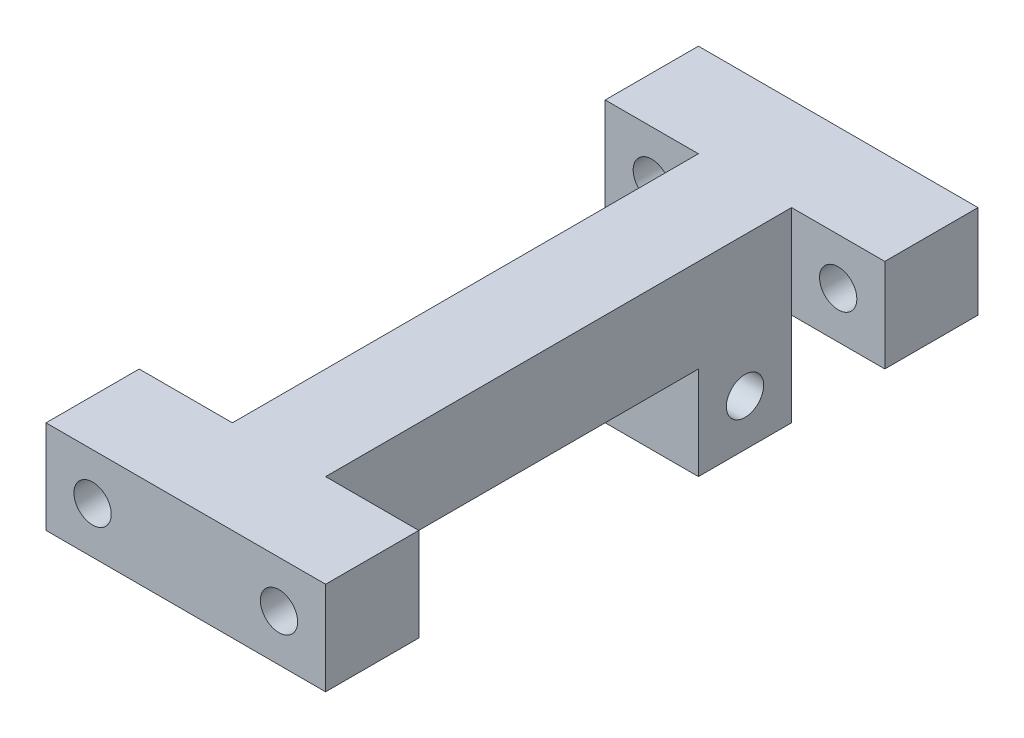
ISO-10303-21;
HEADER;
FILE_DESCRIPTION(('STEP AP214'),'2;1');
FILE_NAME('part.step','',(''),(''),'','','');
FILE_SCHEMA(('AUTOMOTIVE_DESIGN { 1 0 10303 214 1 1 1 1 }'));
ENDSEC;
DATA;
#1=APPLICATION_CONTEXT('core data for automotive mechanical design processes');
#2=APPLICATION_PROTOCOL_DEFINITION('international standard','automotive_design',2000,#1);
#3=PRODUCT_CONTEXT('',#1,'mechanical');
#4=PRODUCT('Part','Part','',(#3));
#5=PRODUCT_RELATED_PRODUCT_CATEGORY('part','',(#4));
#6=PRODUCT_DEFINITION_FORMATION('','',#4);
#7=PRODUCT_DEFINITION_CONTEXT('part definition',#1,'design');
#8=PRODUCT_DEFINITION('design','',#6,#7);
#9=PRODUCT_DEFINITION_SHAPE('','',#8);
#10=(LENGTH_UNIT() NAMED_UNIT(*) SI_UNIT(.MILLI.,.METRE.));
#11=(NAMED_UNIT(*) PLANE_ANGLE_UNIT() SI_UNIT($,.RADIAN.));
#12=(NAMED_UNIT(*) SI_UNIT($,.STERADIAN.) SOLID_ANGLE_UNIT());
#13=UNCERTAINTY_MEASURE_WITH_UNIT(LENGTH_MEASURE(1.E-05),#10,'distance_accuracy_value','');
#14=(GEOMETRIC_REPRESENTATION_CONTEXT(3) GLOBAL_UNCERTAINTY_ASSIGNED_CONTEXT((#13)) GLOBAL_UNIT_ASSIGNED_CONTEXT((#10,
#11,#12)) REPRESENTATION_CONTEXT('',''));
#15=CARTESIAN_POINT('',(0.,0.,0.));
#16=DIRECTION('',(0.,0.,1.));
#17=DIRECTION('',(1.,0.,0.));
#18=AXIS2_PLACEMENT_3D('',#15,#16,#17);
#19=CARTESIAN_POINT('',(-59.,50.,0.));
#20=DIRECTION('',(0.,-1.,0.));
#21=DIRECTION('',(0.,0.,-1.));
#22=AXIS2_PLACEMENT_3D('',#19,#20,#21);
#23=PLANE('',#22);
#24=DIRECTION('',(0.,0.,1.));
#25=VECTOR('',#24,1.);
#26=CARTESIAN_POINT('',(0.,50.,0.));
#27=LINE('',#26,#25);
#28=CARTESIAN_POINT('',(0.,50.,-200.));
#29=VERTEX_POINT('',#28);
#30=CARTESIAN_POINT('',(0.,50.,-50.));
#31=VERTEX_POINT('',#30);
#32=EDGE_CURVE('E192',#29,#31,#27,.T.);
#33=ORIENTED_EDGE('',*,*,#32,.F.);
#34=DIRECTION('',(1.,0.,0.));
#35=VECTOR('',#34,1.);
#36=CARTESIAN_POINT('',(-59.,50.,-200.));
#37=LINE('',#36,#35);
#38=CARTESIAN_POINT('',(50.0000000000001,50.,-200.));
#39=VERTEX_POINT('',#38);
#40=EDGE_CURVE('E279',#29,#39,#37,.T.);
#41=ORIENTED_EDGE('',*,*,#40,.T.);
#42=DIRECTION('',(0.,0.,-1.));
#43=VECTOR('',#42,1.);
#44=CARTESIAN_POINT('',(50.0000000000001,50.,0.));
#45=LINE('',#44,#43);
#46=CARTESIAN_POINT('',(50.0000000000001,50.,-50.));
#47=VERTEX_POINT('',#46);
#48=EDGE_CURVE('E197',#47,#39,#45,.T.);
#49=ORIENTED_EDGE('',*,*,#48,.F.);
#50=DIRECTION('',(1.,0.,0.));
#51=VECTOR('',#50,1.);
#52=CARTESIAN_POINT('',(-59.,50.,-50.));
#53=LINE('',#52,#51);
#54=EDGE_CURVE('E285',#31,#47,#53,.T.);
#55=ORIENTED_EDGE('',*,*,#54,.F.);
#56=EDGE_LOOP('',(#33,#41,#49,#55));
#57=FACE_BOUND('',#56,.T.);
#58=ADVANCED_FACE('F35',(#57),#23,.T.);
#59=DIRECTION('',(1.,0.,0.));
#60=VECTOR('',#59,1.);
#61=CARTESIAN_POINT('',(0.,50.,-250.));
#62=LINE('',#61,#60);
#63=CARTESIAN_POINT('',(-50.,50.,-250.));
#64=VERTEX_POINT('',#63);
#65=CARTESIAN_POINT('',(0.,50.,-250.));
#66=VERTEX_POINT('',#65);
#67=EDGE_CURVE('E183',#64,#66,#62,.T.);
#68=ORIENTED_EDGE('',*,*,#67,.F.);
#69=DIRECTION('',(0.,0.,-1.));
#70=VECTOR('',#69,1.);
#71=CARTESIAN_POINT('',(-50.,50.,0.));
#72=LINE('',#71,#70);
#73=CARTESIAN_POINT('',(-50.,50.,-300.));
#74=VERTEX_POINT('',#73);
#75=EDGE_CURVE('E253',#64,#74,#72,.T.);
#76=ORIENTED_EDGE('',*,*,#75,.T.);
#77=DIRECTION('',(-1.,0.,0.));
#78=VECTOR('',#77,1.);
#79=CARTESIAN_POINT('',(100.,50.,-300.));
#80=LINE('',#79,#78);
#81=CARTESIAN_POINT('',(100.,50.,-300.));
#82=VERTEX_POINT('',#81);
#83=EDGE_CURVE('E226',#82,#74,#80,.T.);
#84=ORIENTED_EDGE('',*,*,#83,.F.);
#85=DIRECTION('',(0.,0.,-1.));
#86=VECTOR('',#85,1.);
#87=CARTESIAN_POINT('',(100.,50.,0.));
#88=LINE('',#87,#86);
#89=CARTESIAN_POINT('',(100.,50.,-250.));
#90=VERTEX_POINT('',#89);
#91=EDGE_CURVE('E257',#90,#82,#88,.T.);
#92=ORIENTED_EDGE('',*,*,#91,.F.);
#93=DIRECTION('',(1.,0.,0.));
#94=VECTOR('',#93,1.);
#95=CARTESIAN_POINT('',(50.0000000000001,50.,-250.));
#96=LINE('',#95,#94);
#97=CARTESIAN_POINT('',(50.0000000000001,50.,-250.));
#98=VERTEX_POINT('',#97);
#99=EDGE_CURVE('E60',#98,#90,#96,.T.);
#100=ORIENTED_EDGE('',*,*,#99,.F.);
#101=DIRECTION('',(-1.,0.,0.));
#102=VECTOR('',#101,1.);
#103=CARTESIAN_POINT('',(100.,50.,-250.));
#104=LINE('',#103,#102);
#105=EDGE_CURVE('E11',#98,#66,#104,.T.);
#106=ORIENTED_EDGE('',*,*,#105,.T.);
#107=EDGE_LOOP('',(#68,#76,#84,#92,#100,#106));
#108=FACE_BOUND('',#107,.T.);
#109=ADVANCED_FACE('F373',(#108),#23,.T.);
#110=CARTESIAN_POINT('',(-50.,0.,0.));
#111=DIRECTION('',(-1.,0.,0.));
#112=DIRECTION('',(0.,0.,-1.));
#113=AXIS2_PLACEMENT_3D('',#110,#111,#112);
#114=PLANE('',#113);
#115=DIRECTION('',(0.,-1.,0.));
#116=VECTOR('',#115,1.);
#117=CARTESIAN_POINT('',(-50.,100.,-250.));
#118=LINE('',#117,#116);
#119=CARTESIAN_POINT('',(-50.,100.,-250.));
#120=VERTEX_POINT('',#119);
#121=EDGE_CURVE('E198',#120,#64,#118,.T.);
#122=ORIENTED_EDGE('',*,*,#121,.F.);
#123=DIRECTION('',(0.,0.,1.));
#124=VECTOR('',#123,1.);
#125=CARTESIAN_POINT('',(-50.,100.,0.));
#126=LINE('',#125,#124);
#127=CARTESIAN_POINT('',(-50.,100.,-300.));
#128=VERTEX_POINT('',#127);
#129=EDGE_CURVE('E251',#128,#120,#126,.T.);
#130=ORIENTED_EDGE('',*,*,#129,.F.);
#131=DIRECTION('',(0.,1.,0.));
#132=VECTOR('',#131,1.);
#133=CARTESIAN_POINT('',(-50.,50.,-300.));
#134=LINE('',#133,#132);
#135=EDGE_CURVE('E229',#74,#128,#134,.T.);
#136=ORIENTED_EDGE('',*,*,#135,.F.);
#137=ORIENTED_EDGE('',*,*,#75,.F.);
#138=EDGE_LOOP('',(#122,#130,#136,#137));
#139=FACE_BOUND('',#138,.T.);
#140=ADVANCED_FACE('F377',(#139),#114,.T.);
#141=CARTESIAN_POINT('',(100.,0.,0.));
#142=DIRECTION('',(1.,0.,0.));
#143=DIRECTION('',(0.,0.,-1.));
#144=AXIS2_PLACEMENT_3D('',#141,#142,#143);
#145=PLANE('',#144);
#146=DIRECTION('',(0.,-1.,0.));
#147=VECTOR('',#146,1.);
#148=CARTESIAN_POINT('',(100.,100.,0.));
#149=LINE('',#148,#147);
#150=CARTESIAN_POINT('',(100.,100.,0.));
#151=VERTEX_POINT('',#150);
#152=CARTESIAN_POINT('',(100.,50.,0.));
#153=VERTEX_POINT('',#152);
#154=EDGE_CURVE('E219',#151,#153,#149,.T.);
#155=ORIENTED_EDGE('',*,*,#154,.F.);
#156=DIRECTION('',(0.,0.,1.));
#157=VECTOR('',#156,1.);
#158=CARTESIAN_POINT('',(100.,100.,0.));
#159=LINE('',#158,#157);
#160=CARTESIAN_POINT('',(100.,100.,50.));
#161=VERTEX_POINT('',#160);
#162=EDGE_CURVE('E261',#151,#161,#159,.T.);
#163=ORIENTED_EDGE('',*,*,#162,.T.);
#164=DIRECTION('',(0.,1.,0.));
#165=VECTOR('',#164,1.);
#166=CARTESIAN_POINT('',(100.,50.,50.));
#167=LINE('',#166,#165);
#168=CARTESIAN_POINT('',(100.,50.,50.));
#169=VERTEX_POINT('',#168);
#170=EDGE_CURVE('E241',#169,#161,#167,.T.);
#171=ORIENTED_EDGE('',*,*,#170,.F.);
#172=EDGE_CURVE('E258',#169,#153,#88,.T.);
#173=ORIENTED_EDGE('',*,*,#172,.T.);
#174=EDGE_LOOP('',(#155,#163,#171,#173));
#175=FACE_BOUND('',#174,.T.);
#176=ADVANCED_FACE('F456',(#175),#145,.T.);
#177=CARTESIAN_POINT('',(50.0000000000001,0.,-250.));
#178=DIRECTION('',(0.,0.,1.));
#179=DIRECTION('',(1.,0.,0.));
#180=AXIS2_PLACEMENT_3D('',#177,#178,#179);
#181=PLANE('',#180);
#182=ORIENTED_EDGE('',*,*,#105,.F.);
#183=DIRECTION('',(0.,1.,0.));
#184=VECTOR('',#183,1.);
#185=CARTESIAN_POINT('',(50.0000000000001,0.,-250.));
#186=LINE('',#185,#184);
#187=CARTESIAN_POINT('',(50.0000000000001,0.,-250.));
#188=VERTEX_POINT('',#187);
#189=EDGE_CURVE('E297',#188,#98,#186,.T.);
#190=ORIENTED_EDGE('',*,*,#189,.F.);
#191=DIRECTION('',(-1.,0.,0.));
#192=VECTOR('',#191,1.);
#193=CARTESIAN_POINT('',(50.0000000000001,0.,-250.));
#194=LINE('',#193,#192);
#195=CARTESIAN_POINT('',(0.,0.,-250.));
#196=VERTEX_POINT('',#195);
#197=EDGE_CURVE('E300',#188,#196,#194,.T.);
#198=ORIENTED_EDGE('',*,*,#197,.T.);
#199=DIRECTION('',(0.,1.,0.));
#200=VECTOR('',#199,1.);
#201=CARTESIAN_POINT('',(0.,0.,-250.));
#202=LINE('',#201,#200);
#203=EDGE_CURVE('E293',#196,#66,#202,.T.);
#204=ORIENTED_EDGE('',*,*,#203,.T.);
#205=EDGE_LOOP('',(#182,#190,#198,#204));
#206=FACE_BOUND('',#205,.T.);
#207=ADVANCED_FACE('F384',(#206),#181,.F.);
#208=CARTESIAN_POINT('',(50.0000000000001,0.,0.));
#209=DIRECTION('',(0.,0.,-1.));
#210=DIRECTION('',(-1.,0.,0.));
#211=AXIS2_PLACEMENT_3D('',#208,#209,#210);
#212=PLANE('',#211);
#213=DIRECTION('',(1.,0.,0.));
#214=VECTOR('',#213,1.);
#215=CARTESIAN_POINT('',(-50.,50.,0.));
#216=LINE('',#215,#214);
#217=CARTESIAN_POINT('',(0.,50.,0.));
#218=VERTEX_POINT('',#217);
#219=CARTESIAN_POINT('',(50.0000000000001,50.,0.));
#220=VERTEX_POINT('',#219);
#221=EDGE_CURVE('E44',#218,#220,#216,.T.);
#222=ORIENTED_EDGE('',*,*,#221,.F.);
#223=DIRECTION('',(0.,-1.,0.));
#224=VECTOR('',#223,1.);
#225=CARTESIAN_POINT('',(0.,0.,0.));
#226=LINE('',#225,#224);
#227=CARTESIAN_POINT('',(0.,0.,0.));
#228=VERTEX_POINT('',#227);
#229=EDGE_CURVE('E171',#218,#228,#226,.T.);
#230=ORIENTED_EDGE('',*,*,#229,.T.);
#231=DIRECTION('',(-1.,0.,0.));
#232=VECTOR('',#231,1.);
#233=CARTESIAN_POINT('',(50.0000000000001,0.,0.));
#234=LINE('',#233,#232);
#235=CARTESIAN_POINT('',(50.0000000000001,0.,0.));
#236=VERTEX_POINT('',#235);
#237=EDGE_CURVE('E310',#236,#228,#234,.T.);
#238=ORIENTED_EDGE('',*,*,#237,.F.);
#239=DIRECTION('',(0.,-1.,0.));
#240=VECTOR('',#239,1.);
#241=CARTESIAN_POINT('',(50.0000000000001,0.,0.));
#242=LINE('',#241,#240);
#243=EDGE_CURVE('E290',#220,#236,#242,.T.);
#244=ORIENTED_EDGE('',*,*,#243,.F.);
#245=EDGE_LOOP('',(#222,#230,#238,#244));
#246=FACE_BOUND('',#245,.T.);
#247=ADVANCED_FACE('F37',(#246),#212,.F.);
#248=CARTESIAN_POINT('',(0.,0.,0.));
#249=DIRECTION('',(-1.,0.,0.));
#250=DIRECTION('',(0.,0.,1.));
#251=AXIS2_PLACEMENT_3D('',#248,#249,#250);
#252=PLANE('',#251);
#253=CARTESIAN_POINT('',(0.,25.,-225.));
#254=DIRECTION('',(-1.,0.,0.));
#255=DIRECTION('',(0.,0.,1.));
#256=AXIS2_PLACEMENT_3D('',#253,#254,#255);
#257=CIRCLE('',#256,10.);
#258=CARTESIAN_POINT('',(0.,25.,-215.));
#259=VERTEX_POINT('',#258);
#260=EDGE_CURVE('E268',#259,#259,#257,.T.);
#261=ORIENTED_EDGE('',*,*,#260,.F.);
#262=EDGE_LOOP('',(#261));
#263=FACE_BOUND('',#262,.T.);
#264=DIRECTION('',(0.,1.,0.));
#265=VECTOR('',#264,1.);
#266=CARTESIAN_POINT('',(0.,0.,-200.));
#267=LINE('',#266,#265);
#268=CARTESIAN_POINT('',(0.,0.,-200.));
#269=VERTEX_POINT('',#268);
#270=EDGE_CURVE('E250',#269,#29,#267,.T.);
#271=ORIENTED_EDGE('',*,*,#270,.T.);
#272=ORIENTED_EDGE('',*,*,#32,.T.);
#273=DIRECTION('',(0.,-1.,0.));
#274=VECTOR('',#273,1.);
#275=CARTESIAN_POINT('',(0.,0.,-50.));
#276=LINE('',#275,#274);
#277=CARTESIAN_POINT('',(0.,0.,-50.));
#278=VERTEX_POINT('',#277);
#279=EDGE_CURVE('E313',#31,#278,#276,.T.);
#280=ORIENTED_EDGE('',*,*,#279,.T.);
#281=DIRECTION('',(0.,0.,-1.));
#282=VECTOR('',#281,1.);
#283=CARTESIAN_POINT('',(0.,0.,0.));
#284=LINE('',#283,#282);
#285=EDGE_CURVE('E303',#228,#278,#284,.T.);
#286=ORIENTED_EDGE('',*,*,#285,.F.);
#287=ORIENTED_EDGE('',*,*,#229,.F.);
#288=DIRECTION('',(0.,-1.,0.));
#289=VECTOR('',#288,1.);
#290=CARTESIAN_POINT('',(0.,100.,0.));
#291=LINE('',#290,#289);
#292=CARTESIAN_POINT('',(0.,100.,0.));
#293=VERTEX_POINT('',#292);
#294=EDGE_CURVE('E162',#293,#218,#291,.T.);
#295=ORIENTED_EDGE('',*,*,#294,.F.);
#296=DIRECTION('',(0.,0.,1.));
#297=VECTOR('',#296,1.);
#298=CARTESIAN_POINT('',(0.,100.,0.));
#299=LINE('',#298,#297);
#300=CARTESIAN_POINT('',(0.,100.,-250.));
#301=VERTEX_POINT('',#300);
#302=EDGE_CURVE('E168',#301,#293,#299,.T.);
#303=ORIENTED_EDGE('',*,*,#302,.F.);
#304=DIRECTION('',(0.,-1.,0.));
#305=VECTOR('',#304,1.);
#306=CARTESIAN_POINT('',(0.,100.,-250.));
#307=LINE('',#306,#305);
#308=EDGE_CURVE('E195',#301,#66,#307,.T.);
#309=ORIENTED_EDGE('',*,*,#308,.T.);
#310=ORIENTED_EDGE('',*,*,#203,.F.);
#311=EDGE_CURVE('E302',#269,#196,#284,.T.);
#312=ORIENTED_EDGE('',*,*,#311,.F.);
#313=EDGE_LOOP('',(#271,#272,#280,#286,#287,#295,#303,#309,#310,#312));
#314=FACE_BOUND('',#313,.T.);
#315=CARTESIAN_POINT('',(0.,25.,-25.));
#316=DIRECTION('',(-1.,0.,0.));
#317=DIRECTION('',(0.,0.,1.));
#318=AXIS2_PLACEMENT_3D('',#315,#316,#317);
#319=CIRCLE('',#318,10.);
#320=CARTESIAN_POINT('',(0.,25.,-15.));
#321=VERTEX_POINT('',#320);
#322=EDGE_CURVE('E272',#321,#321,#319,.T.);
#323=ORIENTED_EDGE('',*,*,#322,.F.);
#324=EDGE_LOOP('',(#323));
#325=FACE_BOUND('',#324,.T.);
#326=ADVANCED_FACE('F165',(#263,#314,#325),#252,.T.);
#327=CARTESIAN_POINT('',(50.0000000000001,0.,0.));
#328=DIRECTION('',(-1.,0.,0.));
#329=DIRECTION('',(0.,0.,1.));
#330=AXIS2_PLACEMENT_3D('',#327,#328,#329);
#331=PLANE('',#330);
#332=CARTESIAN_POINT('',(50.0000000000001,25.,-225.));
#333=DIRECTION('',(1.,0.,0.));
#334=DIRECTION('',(0.,0.,-1.));
#335=AXIS2_PLACEMENT_3D('',#332,#333,#334);
#336=CIRCLE('',#335,10.);
#337=CARTESIAN_POINT('',(50.0000000000001,25.,-235.));
#338=VERTEX_POINT('',#337);
#339=EDGE_CURVE('E265',#338,#338,#336,.T.);
#340=ORIENTED_EDGE('',*,*,#339,.F.);
#341=EDGE_LOOP('',(#340));
#342=FACE_BOUND('',#341,.T.);
#343=ORIENTED_EDGE('',*,*,#189,.T.);
#344=DIRECTION('',(0.,-1.,0.));
#345=VECTOR('',#344,1.);
#346=CARTESIAN_POINT('',(50.0000000000001,100.,-250.));
#347=LINE('',#346,#345);
#348=CARTESIAN_POINT('',(50.0000000000001,100.,-250.));
#349=VERTEX_POINT('',#348);
#350=EDGE_CURVE('E211',#349,#98,#347,.T.);
#351=ORIENTED_EDGE('',*,*,#350,.F.);
#352=DIRECTION('',(0.,0.,-1.));
#353=VECTOR('',#352,1.);
#354=CARTESIAN_POINT('',(50.0000000000001,100.,0.));
#355=LINE('',#354,#353);
#356=CARTESIAN_POINT('',(50.0000000000001,100.,0.));
#357=VERTEX_POINT('',#356);
#358=EDGE_CURVE('E201',#357,#349,#355,.T.);
#359=ORIENTED_EDGE('',*,*,#358,.F.);
#360=DIRECTION('',(0.,-1.,0.));
#361=VECTOR('',#360,1.);
#362=CARTESIAN_POINT('',(50.0000000000001,100.,0.));
#363=LINE('',#362,#361);
#364=EDGE_CURVE('E216',#357,#220,#363,.T.);
#365=ORIENTED_EDGE('',*,*,#364,.T.);
#366=ORIENTED_EDGE('',*,*,#243,.T.);
#367=DIRECTION('',(0.,0.,-1.));
#368=VECTOR('',#367,1.);
#369=CARTESIAN_POINT('',(50.0000000000001,0.,0.));
#370=LINE('',#369,#368);
#371=CARTESIAN_POINT('',(50.0000000000001,0.,-50.));
#372=VERTEX_POINT('',#371);
#373=EDGE_CURVE('E294',#236,#372,#370,.T.);
#374=ORIENTED_EDGE('',*,*,#373,.T.);
#375=DIRECTION('',(0.,1.,0.));
#376=VECTOR('',#375,1.);
#377=CARTESIAN_POINT('',(50.0000000000001,0.,-50.));
#378=LINE('',#377,#376);
#379=EDGE_CURVE('E276',#372,#47,#378,.T.);
#380=ORIENTED_EDGE('',*,*,#379,.T.);
#381=ORIENTED_EDGE('',*,*,#48,.T.);
#382=DIRECTION('',(0.,-1.,0.));
#383=VECTOR('',#382,1.);
#384=CARTESIAN_POINT('',(50.0000000000001,0.,-200.));
#385=LINE('',#384,#383);
#386=CARTESIAN_POINT('',(50.0000000000001,0.,-200.));
#387=VERTEX_POINT('',#386);
#388=EDGE_CURVE('E273',#39,#387,#385,.T.);
#389=ORIENTED_EDGE('',*,*,#388,.T.);
#390=EDGE_CURVE('E292',#387,#188,#370,.T.);
#391=ORIENTED_EDGE('',*,*,#390,.T.);
#392=EDGE_LOOP('',(#343,#351,#359,#365,#366,#374,#380,#381,#389,#391));
#393=FACE_BOUND('',#392,.T.);
#394=CARTESIAN_POINT('',(50.0000000000001,25.,-25.));
#395=DIRECTION('',(1.,0.,0.));
#396=DIRECTION('',(0.,0.,-1.));
#397=AXIS2_PLACEMENT_3D('',#394,#395,#396);
#398=CIRCLE('',#397,10.);
#399=CARTESIAN_POINT('',(50.0000000000001,25.,-35.));
#400=VERTEX_POINT('',#399);
#401=EDGE_CURVE('E269',#400,#400,#398,.T.);
#402=ORIENTED_EDGE('',*,*,#401,.F.);
#403=EDGE_LOOP('',(#402));
#404=FACE_BOUND('',#403,.T.);
#405=ADVANCED_FACE('F386',(#342,#393,#404),#331,.F.);
#406=CARTESIAN_POINT('',(50.0000000000001,0.,0.));
#407=DIRECTION('',(0.,1.,0.));
#408=DIRECTION('',(0.,0.,1.));
#409=AXIS2_PLACEMENT_3D('',#406,#407,#408);
#410=PLANE('',#409);
#411=DIRECTION('',(1.,0.,0.));
#412=VECTOR('',#411,1.);
#413=CARTESIAN_POINT('',(-59.,0.,-200.));
#414=LINE('',#413,#412);
#415=EDGE_CURVE('E280',#269,#387,#414,.T.);
#416=ORIENTED_EDGE('',*,*,#415,.F.);
#417=ORIENTED_EDGE('',*,*,#311,.T.);
#418=ORIENTED_EDGE('',*,*,#197,.F.);
#419=ORIENTED_EDGE('',*,*,#390,.F.);
#420=EDGE_LOOP('',(#416,#417,#418,#419));
#421=FACE_BOUND('',#420,.T.);
#422=ADVANCED_FACE('F393',(#421),#410,.F.);
#423=DIRECTION('',(1.,0.,0.));
#424=VECTOR('',#423,1.);
#425=CARTESIAN_POINT('',(-59.,0.,-50.));
#426=LINE('',#425,#424);
#427=EDGE_CURVE('E282',#278,#372,#426,.T.);
#428=ORIENTED_EDGE('',*,*,#427,.T.);
#429=ORIENTED_EDGE('',*,*,#373,.F.);
#430=ORIENTED_EDGE('',*,*,#237,.T.);
#431=ORIENTED_EDGE('',*,*,#285,.T.);
#432=EDGE_LOOP('',(#428,#429,#430,#431));
#433=FACE_BOUND('',#432,.T.);
#434=ADVANCED_FACE('F438',(#433),#410,.F.);
#435=CARTESIAN_POINT('',(50.0000000000001,100.,0.));
#436=DIRECTION('',(0.,-1.,0.));
#437=DIRECTION('',(0.,0.,-1.));
#438=AXIS2_PLACEMENT_3D('',#435,#436,#437);
#439=PLANE('',#438);
#440=ORIENTED_EDGE('',*,*,#129,.T.);
#441=DIRECTION('',(1.,0.,0.));
#442=VECTOR('',#441,1.);
#443=CARTESIAN_POINT('',(0.,100.,-250.));
#444=LINE('',#443,#442);
#445=EDGE_CURVE('E173',#120,#301,#444,.T.);
#446=ORIENTED_EDGE('',*,*,#445,.T.);
#447=ORIENTED_EDGE('',*,*,#302,.T.);
#448=DIRECTION('',(-1.,0.,0.));
#449=VECTOR('',#448,1.);
#450=CARTESIAN_POINT('',(0.,100.,0.));
#451=LINE('',#450,#449);
#452=CARTESIAN_POINT('',(-50.,100.,0.));
#453=VERTEX_POINT('',#452);
#454=EDGE_CURVE('E176',#293,#453,#451,.T.);
#455=ORIENTED_EDGE('',*,*,#454,.T.);
#456=CARTESIAN_POINT('',(-50.,100.,50.));
#457=VERTEX_POINT('',#456);
#458=EDGE_CURVE('E247',#453,#457,#126,.T.);
#459=ORIENTED_EDGE('',*,*,#458,.T.);
#460=DIRECTION('',(-1.,0.,0.));
#461=VECTOR('',#460,1.);
#462=CARTESIAN_POINT('',(-50.,100.,50.));
#463=LINE('',#462,#461);
#464=EDGE_CURVE('E244',#161,#457,#463,.T.);
#465=ORIENTED_EDGE('',*,*,#464,.F.);
#466=ORIENTED_EDGE('',*,*,#162,.F.);
#467=DIRECTION('',(-1.,0.,0.));
#468=VECTOR('',#467,1.);
#469=CARTESIAN_POINT('',(50.0000000000001,100.,0.));
#470=LINE('',#469,#468);
#471=EDGE_CURVE('E208',#151,#357,#470,.T.);
#472=ORIENTED_EDGE('',*,*,#471,.T.);
#473=ORIENTED_EDGE('',*,*,#358,.T.);
#474=DIRECTION('',(1.,0.,0.));
#475=VECTOR('',#474,1.);
#476=CARTESIAN_POINT('',(50.0000000000001,100.,-250.));
#477=LINE('',#476,#475);
#478=CARTESIAN_POINT('',(100.,100.,-250.));
#479=VERTEX_POINT('',#478);
#480=EDGE_CURVE('E204',#349,#479,#477,.T.);
#481=ORIENTED_EDGE('',*,*,#480,.T.);
#482=CARTESIAN_POINT('',(100.,100.,-300.));
#483=VERTEX_POINT('',#482);
#484=EDGE_CURVE('E262',#483,#479,#159,.T.);
#485=ORIENTED_EDGE('',*,*,#484,.F.);
#486=DIRECTION('',(1.,0.,0.));
#487=VECTOR('',#486,1.);
#488=CARTESIAN_POINT('',(100.,100.,-300.));
#489=LINE('',#488,#487);
#490=EDGE_CURVE('E232',#128,#483,#489,.T.);
#491=ORIENTED_EDGE('',*,*,#490,.F.);
#492=EDGE_LOOP('',(#440,#446,#447,#455,#459,#465,#466,#472,#473,#481,#485,#491));
#493=FACE_BOUND('',#492,.T.);
#494=ADVANCED_FACE('F182',(#493),#439,.F.);
#495=CARTESIAN_POINT('',(-59.,0.,-200.));
#496=DIRECTION('',(0.,0.,1.));
#497=DIRECTION('',(1.,0.,0.));
#498=AXIS2_PLACEMENT_3D('',#495,#496,#497);
#499=PLANE('',#498);
#500=ORIENTED_EDGE('',*,*,#415,.T.);
#501=ORIENTED_EDGE('',*,*,#388,.F.);
#502=ORIENTED_EDGE('',*,*,#40,.F.);
#503=ORIENTED_EDGE('',*,*,#270,.F.);
#504=EDGE_LOOP('',(#500,#501,#502,#503));
#505=FACE_BOUND('',#504,.T.);
#506=ADVANCED_FACE('F428',(#505),#499,.T.);
#507=CARTESIAN_POINT('',(-59.,0.,-50.));
#508=DIRECTION('',(0.,0.,-1.));
#509=DIRECTION('',(-1.,0.,0.));
#510=AXIS2_PLACEMENT_3D('',#507,#508,#509);
#511=PLANE('',#510);
#512=ORIENTED_EDGE('',*,*,#54,.T.);
#513=ORIENTED_EDGE('',*,*,#379,.F.);
#514=ORIENTED_EDGE('',*,*,#427,.F.);
#515=ORIENTED_EDGE('',*,*,#279,.F.);
#516=EDGE_LOOP('',(#512,#513,#514,#515));
#517=FACE_BOUND('',#516,.T.);
#518=ADVANCED_FACE('F419',(#517),#511,.T.);
#519=DIRECTION('',(-1.,0.,0.));
#520=VECTOR('',#519,1.);
#521=CARTESIAN_POINT('',(0.,50.,0.));
#522=LINE('',#521,#520);
#523=CARTESIAN_POINT('',(-50.,50.,0.));
#524=VERTEX_POINT('',#523);
#525=EDGE_CURVE('E52',#218,#524,#522,.T.);
#526=ORIENTED_EDGE('',*,*,#525,.F.);
#527=ORIENTED_EDGE('',*,*,#221,.T.);
#528=DIRECTION('',(-1.,0.,0.));
#529=VECTOR('',#528,1.);
#530=CARTESIAN_POINT('',(50.0000000000001,50.,0.));
#531=LINE('',#530,#529);
#532=EDGE_CURVE('E205',#153,#220,#531,.T.);
#533=ORIENTED_EDGE('',*,*,#532,.F.);
#534=ORIENTED_EDGE('',*,*,#172,.F.);
#535=DIRECTION('',(1.,0.,0.));
#536=VECTOR('',#535,1.);
#537=CARTESIAN_POINT('',(-50.,50.,50.));
#538=LINE('',#537,#536);
#539=CARTESIAN_POINT('',(-50.,50.,50.));
#540=VERTEX_POINT('',#539);
#541=EDGE_CURVE('E238',#540,#169,#538,.T.);
#542=ORIENTED_EDGE('',*,*,#541,.F.);
#543=EDGE_CURVE('E254',#540,#524,#72,.T.);
#544=ORIENTED_EDGE('',*,*,#543,.T.);
#545=EDGE_LOOP('',(#526,#527,#533,#534,#542,#544));
#546=FACE_BOUND('',#545,.T.);
#547=ADVANCED_FACE('F411',(#546),#23,.T.);
#548=CARTESIAN_POINT('',(-59.,25.,-25.));
#549=DIRECTION('',(1.,0.,0.));
#550=DIRECTION('',(0.,0.,-1.));
#551=AXIS2_PLACEMENT_3D('',#548,#549,#550);
#552=CYLINDRICAL_SURFACE('',#551,10.);
#553=ORIENTED_EDGE('',*,*,#322,.T.);
#554=EDGE_LOOP('',(#553));
#555=FACE_BOUND('',#554,.T.);
#556=ORIENTED_EDGE('',*,*,#401,.T.);
#557=EDGE_LOOP('',(#556));
#558=FACE_BOUND('',#557,.T.);
#559=ADVANCED_FACE('F418',(#555,#558),#552,.F.);
#560=CARTESIAN_POINT('',(-59.,25.,-225.));
#561=DIRECTION('',(1.,0.,0.));
#562=DIRECTION('',(0.,0.,-1.));
#563=AXIS2_PLACEMENT_3D('',#560,#561,#562);
#564=CYLINDRICAL_SURFACE('',#563,10.);
#565=ORIENTED_EDGE('',*,*,#260,.T.);
#566=EDGE_LOOP('',(#565));
#567=FACE_BOUND('',#566,.T.);
#568=ORIENTED_EDGE('',*,*,#339,.T.);
#569=EDGE_LOOP('',(#568));
#570=FACE_BOUND('',#569,.T.);
#571=ADVANCED_FACE('F425',(#567,#570),#564,.F.);
#572=DIRECTION('',(0.,-1.,0.));
#573=VECTOR('',#572,1.);
#574=CARTESIAN_POINT('',(100.,100.,-250.));
#575=LINE('',#574,#573);
#576=EDGE_CURVE('E221',#479,#90,#575,.T.);
#577=ORIENTED_EDGE('',*,*,#576,.T.);
#578=ORIENTED_EDGE('',*,*,#91,.T.);
#579=DIRECTION('',(0.,-1.,0.));
#580=VECTOR('',#579,1.);
#581=CARTESIAN_POINT('',(100.,50.,-300.));
#582=LINE('',#581,#580);
#583=EDGE_CURVE('E218',#483,#82,#582,.T.);
#584=ORIENTED_EDGE('',*,*,#583,.F.);
#585=ORIENTED_EDGE('',*,*,#484,.T.);
#586=EDGE_LOOP('',(#577,#578,#584,#585));
#587=FACE_BOUND('',#586,.T.);
#588=ADVANCED_FACE('F369',(#587),#145,.T.);
#589=DIRECTION('',(0.,-1.,0.));
#590=VECTOR('',#589,1.);
#591=CARTESIAN_POINT('',(-50.,100.,0.));
#592=LINE('',#591,#590);
#593=EDGE_CURVE('E172',#453,#524,#592,.T.);
#594=ORIENTED_EDGE('',*,*,#593,.T.);
#595=ORIENTED_EDGE('',*,*,#543,.F.);
#596=DIRECTION('',(0.,-1.,0.));
#597=VECTOR('',#596,1.);
#598=CARTESIAN_POINT('',(-50.,50.,50.));
#599=LINE('',#598,#597);
#600=EDGE_CURVE('E234',#457,#540,#599,.T.);
#601=ORIENTED_EDGE('',*,*,#600,.F.);
#602=ORIENTED_EDGE('',*,*,#458,.F.);
#603=EDGE_LOOP('',(#594,#595,#601,#602));
#604=FACE_BOUND('',#603,.T.);
#605=ADVANCED_FACE('F500',(#604),#114,.T.);
#606=CARTESIAN_POINT('',(0.,0.,50.));
#607=DIRECTION('',(0.,0.,-1.));
#608=DIRECTION('',(-1.,0.,0.));
#609=AXIS2_PLACEMENT_3D('',#606,#607,#608);
#610=PLANE('',#609);
#611=CARTESIAN_POINT('',(75.0000000000001,75.,50.));
#612=DIRECTION('',(0.,0.,1.));
#613=DIRECTION('',(1.,0.,0.));
#614=AXIS2_PLACEMENT_3D('',#611,#612,#613);
#615=CIRCLE('',#614,9.99999999999999);
#616=CARTESIAN_POINT('',(85.0000000000001,75.,50.));
#617=VERTEX_POINT('',#616);
#618=EDGE_CURVE('E338',#617,#617,#615,.T.);
#619=ORIENTED_EDGE('',*,*,#618,.F.);
#620=EDGE_LOOP('',(#619));
#621=FACE_BOUND('',#620,.T.);
#622=CARTESIAN_POINT('',(-25.,75.,50.));
#623=DIRECTION('',(0.,0.,1.));
#624=DIRECTION('',(1.,0.,0.));
#625=AXIS2_PLACEMENT_3D('',#622,#623,#624);
#626=CIRCLE('',#625,10.);
#627=CARTESIAN_POINT('',(-15.,75.,50.));
#628=VERTEX_POINT('',#627);
#629=EDGE_CURVE('E323',#628,#628,#626,.T.);
#630=ORIENTED_EDGE('',*,*,#629,.F.);
#631=EDGE_LOOP('',(#630));
#632=FACE_BOUND('',#631,.T.);
#633=ORIENTED_EDGE('',*,*,#600,.T.);
#634=ORIENTED_EDGE('',*,*,#541,.T.);
#635=ORIENTED_EDGE('',*,*,#170,.T.);
#636=ORIENTED_EDGE('',*,*,#464,.T.);
#637=EDGE_LOOP('',(#633,#634,#635,#636));
#638=FACE_BOUND('',#637,.T.);
#639=ADVANCED_FACE('F359',(#621,#632,#638),#610,.F.);
#640=CARTESIAN_POINT('',(0.,0.,-300.));
#641=DIRECTION('',(0.,0.,1.));
#642=DIRECTION('',(1.,0.,0.));
#643=AXIS2_PLACEMENT_3D('',#640,#641,#642);
#644=PLANE('',#643);
#645=CARTESIAN_POINT('',(75.0000000000001,75.,-300.));
#646=DIRECTION('',(0.,0.,1.));
#647=DIRECTION('',(1.,0.,0.));
#648=AXIS2_PLACEMENT_3D('',#645,#646,#647);
#649=CIRCLE('',#648,9.99999999999999);
#650=CARTESIAN_POINT('',(85.0000000000001,75.,-300.));
#651=VERTEX_POINT('',#650);
#652=EDGE_CURVE('E328',#651,#651,#649,.T.);
#653=ORIENTED_EDGE('',*,*,#652,.T.);
#654=EDGE_LOOP('',(#653));
#655=FACE_BOUND('',#654,.T.);
#656=CARTESIAN_POINT('',(-25.,75.,-300.));
#657=DIRECTION('',(0.,0.,1.));
#658=DIRECTION('',(1.,0.,0.));
#659=AXIS2_PLACEMENT_3D('',#656,#657,#658);
#660=CIRCLE('',#659,10.);
#661=CARTESIAN_POINT('',(-15.,75.,-300.));
#662=VERTEX_POINT('',#661);
#663=EDGE_CURVE('E188',#662,#662,#660,.T.);
#664=ORIENTED_EDGE('',*,*,#663,.T.);
#665=EDGE_LOOP('',(#664));
#666=FACE_BOUND('',#665,.T.);
#667=ORIENTED_EDGE('',*,*,#583,.T.);
#668=ORIENTED_EDGE('',*,*,#83,.T.);
#669=ORIENTED_EDGE('',*,*,#135,.T.);
#670=ORIENTED_EDGE('',*,*,#490,.T.);
#671=EDGE_LOOP('',(#667,#668,#669,#670));
#672=FACE_BOUND('',#671,.T.);
#673=ADVANCED_FACE('F355',(#655,#666,#672),#644,.F.);
#674=CARTESIAN_POINT('',(50.0000000000001,100.,0.));
#675=DIRECTION('',(0.,0.,1.));
#676=DIRECTION('',(1.,0.,0.));
#677=AXIS2_PLACEMENT_3D('',#674,#675,#676);
#678=PLANE('',#677);
#679=CARTESIAN_POINT('',(75.0000000000001,75.,0.));
#680=DIRECTION('',(0.,0.,1.));
#681=DIRECTION('',(1.,0.,0.));
#682=AXIS2_PLACEMENT_3D('',#679,#680,#681);
#683=CIRCLE('',#682,9.99999999999999);
#684=CARTESIAN_POINT('',(85.0000000000001,75.,0.));
#685=VERTEX_POINT('',#684);
#686=EDGE_CURVE('E333',#685,#685,#683,.T.);
#687=ORIENTED_EDGE('',*,*,#686,.T.);
#688=EDGE_LOOP('',(#687));
#689=FACE_BOUND('',#688,.T.);
#690=ORIENTED_EDGE('',*,*,#532,.T.);
#691=ORIENTED_EDGE('',*,*,#364,.F.);
#692=ORIENTED_EDGE('',*,*,#471,.F.);
#693=ORIENTED_EDGE('',*,*,#154,.T.);
#694=EDGE_LOOP('',(#690,#691,#692,#693));
#695=FACE_BOUND('',#694,.T.);
#696=ADVANCED_FACE('F358',(#689,#695),#678,.F.);
#697=CARTESIAN_POINT('',(50.0000000000001,100.,-250.));
#698=DIRECTION('',(0.,0.,-1.));
#699=DIRECTION('',(-1.,0.,0.));
#700=AXIS2_PLACEMENT_3D('',#697,#698,#699);
#701=PLANE('',#700);
#702=CARTESIAN_POINT('',(75.0000000000001,75.,-250.));
#703=DIRECTION('',(0.,0.,-1.));
#704=DIRECTION('',(-1.,0.,0.));
#705=AXIS2_PLACEMENT_3D('',#702,#703,#704);
#706=CIRCLE('',#705,9.99999999999999);
#707=CARTESIAN_POINT('',(65.0000000000001,75.,-250.));
#708=VERTEX_POINT('',#707);
#709=EDGE_CURVE('E39',#708,#708,#706,.T.);
#710=ORIENTED_EDGE('',*,*,#709,.T.);
#711=EDGE_LOOP('',(#710));
#712=FACE_BOUND('',#711,.T.);
#713=ORIENTED_EDGE('',*,*,#99,.T.);
#714=ORIENTED_EDGE('',*,*,#576,.F.);
#715=ORIENTED_EDGE('',*,*,#480,.F.);
#716=ORIENTED_EDGE('',*,*,#350,.T.);
#717=EDGE_LOOP('',(#713,#714,#715,#716));
#718=FACE_BOUND('',#717,.T.);
#719=ADVANCED_FACE('F345',(#712,#718),#701,.F.);
#720=CARTESIAN_POINT('',(0.,100.,-250.));
#721=DIRECTION('',(0.,0.,-1.));
#722=DIRECTION('',(-1.,0.,0.));
#723=AXIS2_PLACEMENT_3D('',#720,#721,#722);
#724=PLANE('',#723);
#725=CARTESIAN_POINT('',(-25.,75.,-250.));
#726=DIRECTION('',(0.,0.,-1.));
#727=DIRECTION('',(-1.,0.,0.));
#728=AXIS2_PLACEMENT_3D('',#725,#726,#727);
#729=CIRCLE('',#728,10.);
#730=CARTESIAN_POINT('',(-35.,75.,-250.));
#731=VERTEX_POINT('',#730);
#732=EDGE_CURVE('E322',#731,#731,#729,.T.);
#733=ORIENTED_EDGE('',*,*,#732,.T.);
#734=EDGE_LOOP('',(#733));
#735=FACE_BOUND('',#734,.T.);
#736=ORIENTED_EDGE('',*,*,#67,.T.);
#737=ORIENTED_EDGE('',*,*,#308,.F.);
#738=ORIENTED_EDGE('',*,*,#445,.F.);
#739=ORIENTED_EDGE('',*,*,#121,.T.);
#740=EDGE_LOOP('',(#736,#737,#738,#739));
#741=FACE_BOUND('',#740,.T.);
#742=ADVANCED_FACE('F396',(#735,#741),#724,.F.);
#743=CARTESIAN_POINT('',(0.,100.,0.));
#744=DIRECTION('',(0.,0.,1.));
#745=DIRECTION('',(1.,0.,0.));
#746=AXIS2_PLACEMENT_3D('',#743,#744,#745);
#747=PLANE('',#746);
#748=CARTESIAN_POINT('',(-25.,75.,0.));
#749=DIRECTION('',(0.,0.,1.));
#750=DIRECTION('',(1.,0.,0.));
#751=AXIS2_PLACEMENT_3D('',#748,#749,#750);
#752=CIRCLE('',#751,10.);
#753=CARTESIAN_POINT('',(-15.,75.,0.));
#754=VERTEX_POINT('',#753);
#755=EDGE_CURVE('E320',#754,#754,#752,.T.);
#756=ORIENTED_EDGE('',*,*,#755,.T.);
#757=EDGE_LOOP('',(#756));
#758=FACE_BOUND('',#757,.T.);
#759=ORIENTED_EDGE('',*,*,#525,.T.);
#760=ORIENTED_EDGE('',*,*,#593,.F.);
#761=ORIENTED_EDGE('',*,*,#454,.F.);
#762=ORIENTED_EDGE('',*,*,#294,.T.);
#763=EDGE_LOOP('',(#759,#760,#761,#762));
#764=FACE_BOUND('',#763,.T.);
#765=ADVANCED_FACE('F177',(#758,#764),#747,.F.);
#766=CARTESIAN_POINT('',(-25.,75.,-348.));
#767=DIRECTION('',(0.,0.,1.));
#768=DIRECTION('',(1.,0.,0.));
#769=AXIS2_PLACEMENT_3D('',#766,#767,#768);
#770=CYLINDRICAL_SURFACE('',#769,10.);
#771=ORIENTED_EDGE('',*,*,#629,.T.);
#772=EDGE_LOOP('',(#771));
#773=FACE_BOUND('',#772,.T.);
#774=ORIENTED_EDGE('',*,*,#755,.F.);
#775=EDGE_LOOP('',(#774));
#776=FACE_BOUND('',#775,.T.);
#777=ADVANCED_FACE('F404',(#773,#776),#770,.F.);
#778=ORIENTED_EDGE('',*,*,#732,.F.);
#779=EDGE_LOOP('',(#778));
#780=FACE_BOUND('',#779,.T.);
#781=ORIENTED_EDGE('',*,*,#663,.F.);
#782=EDGE_LOOP('',(#781));
#783=FACE_BOUND('',#782,.T.);
#784=ADVANCED_FACE('F351',(#780,#783),#770,.F.);
#785=CARTESIAN_POINT('',(75.0000000000001,75.,-348.));
#786=DIRECTION('',(0.,0.,1.));
#787=DIRECTION('',(1.,0.,0.));
#788=AXIS2_PLACEMENT_3D('',#785,#786,#787);
#789=CYLINDRICAL_SURFACE('',#788,9.99999999999999);
#790=ORIENTED_EDGE('',*,*,#709,.F.);
#791=EDGE_LOOP('',(#790));
#792=FACE_BOUND('',#791,.T.);
#793=ORIENTED_EDGE('',*,*,#652,.F.);
#794=EDGE_LOOP('',(#793));
#795=FACE_BOUND('',#794,.T.);
#796=ADVANCED_FACE('F347',(#792,#795),#789,.F.);
#797=ORIENTED_EDGE('',*,*,#618,.T.);
#798=EDGE_LOOP('',(#797));
#799=FACE_BOUND('',#798,.T.);
#800=ORIENTED_EDGE('',*,*,#686,.F.);
#801=EDGE_LOOP('',(#800));
#802=FACE_BOUND('',#801,.T.);
#803=ADVANCED_FACE('F350',(#799,#802),#789,.F.);
#804=CLOSED_SHELL('',(#58,#109,#140,#176,#207,#247,#326,#405,#422,#434,#494,#506,#518,#547,#559,
#571,#588,#605,#639,#673,#696,#719,#742,#765,#777,#784,#796,#803));
#805=MANIFOLD_SOLID_BREP('B2',#804);
#806=ADVANCED_BREP_SHAPE_REPRESENTATION('',(#18,#805),#14);
#807=SHAPE_DEFINITION_REPRESENTATION(#9,#806);
ENDSEC;
END-ISO-10303-21;
